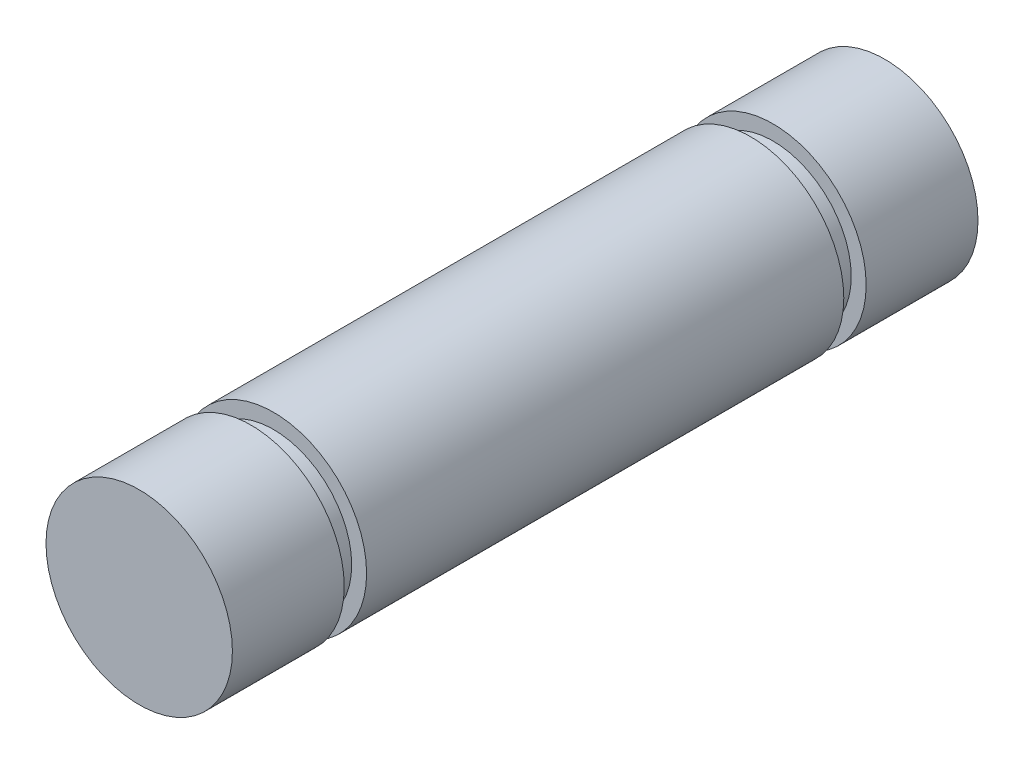
ISO-10303-21;
HEADER;
FILE_DESCRIPTION(('STEP AP214'),'2;1');
FILE_NAME('part.step','',(''),(''),'','','');
FILE_SCHEMA(('AUTOMOTIVE_DESIGN { 1 0 10303 214 1 1 1 1 }'));
ENDSEC;
DATA;
#1=APPLICATION_CONTEXT('core data for automotive mechanical design processes');
#2=APPLICATION_PROTOCOL_DEFINITION('international standard','automotive_design',2000,#1);
#3=PRODUCT_CONTEXT('',#1,'mechanical');
#4=PRODUCT('Part','Part','',(#3));
#5=PRODUCT_RELATED_PRODUCT_CATEGORY('part','',(#4));
#6=PRODUCT_DEFINITION_FORMATION('','',#4);
#7=PRODUCT_DEFINITION_CONTEXT('part definition',#1,'design');
#8=PRODUCT_DEFINITION('design','',#6,#7);
#9=PRODUCT_DEFINITION_SHAPE('','',#8);
#10=(LENGTH_UNIT() NAMED_UNIT(*) SI_UNIT(.MILLI.,.METRE.));
#11=(NAMED_UNIT(*) PLANE_ANGLE_UNIT() SI_UNIT($,.RADIAN.));
#12=(NAMED_UNIT(*) SI_UNIT($,.STERADIAN.) SOLID_ANGLE_UNIT());
#13=UNCERTAINTY_MEASURE_WITH_UNIT(LENGTH_MEASURE(1.E-05),#10,'distance_accuracy_value','');
#14=(GEOMETRIC_REPRESENTATION_CONTEXT(3) GLOBAL_UNCERTAINTY_ASSIGNED_CONTEXT((#13)) GLOBAL_UNIT_ASSIGNED_CONTEXT((#10,
#11,#12)) REPRESENTATION_CONTEXT('',''));
#15=CARTESIAN_POINT('',(0.,0.,0.));
#16=DIRECTION('',(0.,0.,1.));
#17=DIRECTION('',(1.,0.,0.));
#18=AXIS2_PLACEMENT_3D('',#15,#16,#17);
#19=CARTESIAN_POINT('',(0.,0.,12.7));
#20=DIRECTION('',(0.,0.,-1.));
#21=DIRECTION('',(-1.,0.,0.));
#22=AXIS2_PLACEMENT_3D('',#19,#20,#21);
#23=CYLINDRICAL_SURFACE('',#22,3.175);
#24=CARTESIAN_POINT('',(0.,0.,-8.89));
#25=DIRECTION('',(0.,0.,1.));
#26=DIRECTION('',(1.,0.,0.));
#27=AXIS2_PLACEMENT_3D('',#24,#25,#26);
#28=CIRCLE('',#27,3.175);
#29=CARTESIAN_POINT('',(3.175,0.,-8.89));
#30=VERTEX_POINT('',#29);
#31=EDGE_CURVE('E52',#30,#30,#28,.T.);
#32=ORIENTED_EDGE('',*,*,#31,.F.);
#33=EDGE_LOOP('',(#32));
#34=FACE_BOUND('',#33,.T.);
#35=CARTESIAN_POINT('',(0.,0.,-12.7));
#36=DIRECTION('',(0.,0.,1.));
#37=DIRECTION('',(1.,0.,0.));
#38=AXIS2_PLACEMENT_3D('',#35,#36,#37);
#39=CIRCLE('',#38,3.175);
#40=CARTESIAN_POINT('',(3.175,0.,-12.7));
#41=VERTEX_POINT('',#40);
#42=EDGE_CURVE('E40',#41,#41,#39,.T.);
#43=ORIENTED_EDGE('',*,*,#42,.T.);
#44=EDGE_LOOP('',(#43));
#45=FACE_BOUND('',#44,.T.);
#46=ADVANCED_FACE('F37',(#34,#45),#23,.T.);
#47=CARTESIAN_POINT('',(0.,0.,-12.7));
#48=DIRECTION('',(0.,0.,1.));
#49=DIRECTION('',(1.,0.,0.));
#50=AXIS2_PLACEMENT_3D('',#47,#48,#49);
#51=PLANE('',#50);
#52=ORIENTED_EDGE('',*,*,#42,.F.);
#53=EDGE_LOOP('',(#52));
#54=FACE_BOUND('',#53,.T.);
#55=ADVANCED_FACE('F77',(#54),#51,.F.);
#56=CARTESIAN_POINT('',(3.175,0.,-8.128));
#57=DIRECTION('',(0.,0.,1.));
#58=DIRECTION('',(1.,0.,0.));
#59=AXIS2_PLACEMENT_3D('',#56,#57,#58);
#60=PLANE('',#59);
#61=CARTESIAN_POINT('',(0.,0.,-8.128));
#62=DIRECTION('',(0.,0.,1.));
#63=DIRECTION('',(1.,0.,0.));
#64=AXIS2_PLACEMENT_3D('',#61,#62,#63);
#65=CIRCLE('',#64,3.175);
#66=CARTESIAN_POINT('',(3.175,0.,-8.128));
#67=VERTEX_POINT('',#66);
#68=EDGE_CURVE('E47',#67,#67,#65,.T.);
#69=ORIENTED_EDGE('',*,*,#68,.F.);
#70=EDGE_LOOP('',(#69));
#71=FACE_BOUND('',#70,.T.);
#72=CARTESIAN_POINT('',(0.,0.,-8.128));
#73=DIRECTION('',(0.,0.,1.));
#74=DIRECTION('',(1.,0.,0.));
#75=AXIS2_PLACEMENT_3D('',#72,#73,#74);
#76=CIRCLE('',#75,2.667);
#77=CARTESIAN_POINT('',(2.667,0.,-8.128));
#78=VERTEX_POINT('',#77);
#79=EDGE_CURVE('E64',#78,#78,#76,.T.);
#80=ORIENTED_EDGE('',*,*,#79,.T.);
#81=EDGE_LOOP('',(#80));
#82=FACE_BOUND('',#81,.T.);
#83=ADVANCED_FACE('F83',(#71,#82),#60,.F.);
#84=CARTESIAN_POINT('',(0.,0.,12.7));
#85=DIRECTION('',(0.,0.,1.));
#86=DIRECTION('',(1.,0.,0.));
#87=AXIS2_PLACEMENT_3D('',#84,#85,#86);
#88=CYLINDRICAL_SURFACE('',#87,2.667);
#89=ORIENTED_EDGE('',*,*,#79,.F.);
#90=EDGE_LOOP('',(#89));
#91=FACE_BOUND('',#90,.T.);
#92=CARTESIAN_POINT('',(0.,0.,-8.89));
#93=DIRECTION('',(0.,0.,1.));
#94=DIRECTION('',(1.,0.,0.));
#95=AXIS2_PLACEMENT_3D('',#92,#93,#94);
#96=CIRCLE('',#95,2.667);
#97=CARTESIAN_POINT('',(2.667,0.,-8.89));
#98=VERTEX_POINT('',#97);
#99=EDGE_CURVE('E67',#98,#98,#96,.T.);
#100=ORIENTED_EDGE('',*,*,#99,.T.);
#101=EDGE_LOOP('',(#100));
#102=FACE_BOUND('',#101,.T.);
#103=ADVANCED_FACE('F88',(#91,#102),#88,.T.);
#104=CARTESIAN_POINT('',(3.175,0.,-8.89));
#105=DIRECTION('',(0.,0.,-1.));
#106=DIRECTION('',(-1.,0.,0.));
#107=AXIS2_PLACEMENT_3D('',#104,#105,#106);
#108=PLANE('',#107);
#109=ORIENTED_EDGE('',*,*,#99,.F.);
#110=EDGE_LOOP('',(#109));
#111=FACE_BOUND('',#110,.T.);
#112=ORIENTED_EDGE('',*,*,#31,.T.);
#113=EDGE_LOOP('',(#112));
#114=FACE_BOUND('',#113,.T.);
#115=ADVANCED_FACE('F73',(#111,#114),#108,.F.);
#116=ORIENTED_EDGE('',*,*,#68,.T.);
#117=EDGE_LOOP('',(#116));
#118=FACE_BOUND('',#117,.T.);
#119=CARTESIAN_POINT('',(0.,0.,8.128));
#120=DIRECTION('',(0.,0.,1.));
#121=DIRECTION('',(1.,0.,0.));
#122=AXIS2_PLACEMENT_3D('',#119,#120,#121);
#123=CIRCLE('',#122,3.175);
#124=CARTESIAN_POINT('',(3.175,0.,8.128));
#125=VERTEX_POINT('',#124);
#126=EDGE_CURVE('E59',#125,#125,#123,.T.);
#127=ORIENTED_EDGE('',*,*,#126,.F.);
#128=EDGE_LOOP('',(#127));
#129=FACE_BOUND('',#128,.T.);
#130=ADVANCED_FACE('F78',(#118,#129),#23,.T.);
#131=CARTESIAN_POINT('',(3.175,0.,8.89));
#132=DIRECTION('',(0.,0.,1.));
#133=DIRECTION('',(1.,0.,0.));
#134=AXIS2_PLACEMENT_3D('',#131,#132,#133);
#135=PLANE('',#134);
#136=CARTESIAN_POINT('',(0.,0.,8.89));
#137=DIRECTION('',(0.,0.,1.));
#138=DIRECTION('',(1.,0.,0.));
#139=AXIS2_PLACEMENT_3D('',#136,#137,#138);
#140=CIRCLE('',#139,3.175);
#141=CARTESIAN_POINT('',(3.175,0.,8.89));
#142=VERTEX_POINT('',#141);
#143=EDGE_CURVE('E49',#142,#142,#140,.T.);
#144=ORIENTED_EDGE('',*,*,#143,.F.);
#145=EDGE_LOOP('',(#144));
#146=FACE_BOUND('',#145,.T.);
#147=CARTESIAN_POINT('',(0.,0.,8.89));
#148=DIRECTION('',(0.,0.,1.));
#149=DIRECTION('',(1.,0.,0.));
#150=AXIS2_PLACEMENT_3D('',#147,#148,#149);
#151=CIRCLE('',#150,2.667);
#152=CARTESIAN_POINT('',(2.667,0.,8.89));
#153=VERTEX_POINT('',#152);
#154=EDGE_CURVE('E53',#153,#153,#151,.T.);
#155=ORIENTED_EDGE('',*,*,#154,.T.);
#156=EDGE_LOOP('',(#155));
#157=FACE_BOUND('',#156,.T.);
#158=ADVANCED_FACE('F95',(#146,#157),#135,.F.);
#159=CARTESIAN_POINT('',(0.,0.,12.7));
#160=DIRECTION('',(0.,0.,1.));
#161=DIRECTION('',(1.,0.,0.));
#162=AXIS2_PLACEMENT_3D('',#159,#160,#161);
#163=CYLINDRICAL_SURFACE('',#162,2.667);
#164=ORIENTED_EDGE('',*,*,#154,.F.);
#165=EDGE_LOOP('',(#164));
#166=FACE_BOUND('',#165,.T.);
#167=CARTESIAN_POINT('',(0.,0.,8.128));
#168=DIRECTION('',(0.,0.,1.));
#169=DIRECTION('',(1.,0.,0.));
#170=AXIS2_PLACEMENT_3D('',#167,#168,#169);
#171=CIRCLE('',#170,2.667);
#172=CARTESIAN_POINT('',(2.667,0.,8.128));
#173=VERTEX_POINT('',#172);
#174=EDGE_CURVE('E56',#173,#173,#171,.T.);
#175=ORIENTED_EDGE('',*,*,#174,.T.);
#176=EDGE_LOOP('',(#175));
#177=FACE_BOUND('',#176,.T.);
#178=ADVANCED_FACE('F98',(#166,#177),#163,.T.);
#179=CARTESIAN_POINT('',(3.175,0.,8.128));
#180=DIRECTION('',(0.,0.,-1.));
#181=DIRECTION('',(-1.,0.,0.));
#182=AXIS2_PLACEMENT_3D('',#179,#180,#181);
#183=PLANE('',#182);
#184=ORIENTED_EDGE('',*,*,#174,.F.);
#185=EDGE_LOOP('',(#184));
#186=FACE_BOUND('',#185,.T.);
#187=ORIENTED_EDGE('',*,*,#126,.T.);
#188=EDGE_LOOP('',(#187));
#189=FACE_BOUND('',#188,.T.);
#190=ADVANCED_FACE('F94',(#186,#189),#183,.F.);
#191=CARTESIAN_POINT('',(0.,0.,12.7));
#192=DIRECTION('',(0.,0.,1.));
#193=DIRECTION('',(1.,0.,0.));
#194=AXIS2_PLACEMENT_3D('',#191,#192,#193);
#195=PLANE('',#194);
#196=CARTESIAN_POINT('',(0.,0.,12.7));
#197=DIRECTION('',(0.,0.,1.));
#198=DIRECTION('',(1.,0.,0.));
#199=AXIS2_PLACEMENT_3D('',#196,#197,#198);
#200=CIRCLE('',#199,3.175);
#201=CARTESIAN_POINT('',(3.175,0.,12.7));
#202=VERTEX_POINT('',#201);
#203=EDGE_CURVE('E10',#202,#202,#200,.T.);
#204=ORIENTED_EDGE('',*,*,#203,.T.);
#205=EDGE_LOOP('',(#204));
#206=FACE_BOUND('',#205,.T.);
#207=ADVANCED_FACE('F92',(#206),#195,.T.);
#208=ORIENTED_EDGE('',*,*,#143,.T.);
#209=EDGE_LOOP('',(#208));
#210=FACE_BOUND('',#209,.T.);
#211=ORIENTED_EDGE('',*,*,#203,.F.);
#212=EDGE_LOOP('',(#211));
#213=FACE_BOUND('',#212,.T.);
#214=ADVANCED_FACE('F79',(#210,#213),#23,.T.);
#215=CLOSED_SHELL('',(#46,#55,#83,#103,#115,#130,#158,#178,#190,#207,#214));
#216=MANIFOLD_SOLID_BREP('B2',#215);
#217=ADVANCED_BREP_SHAPE_REPRESENTATION('',(#18,#216),#14);
#218=SHAPE_DEFINITION_REPRESENTATION(#9,#217);
ENDSEC;
END-ISO-10303-21;
